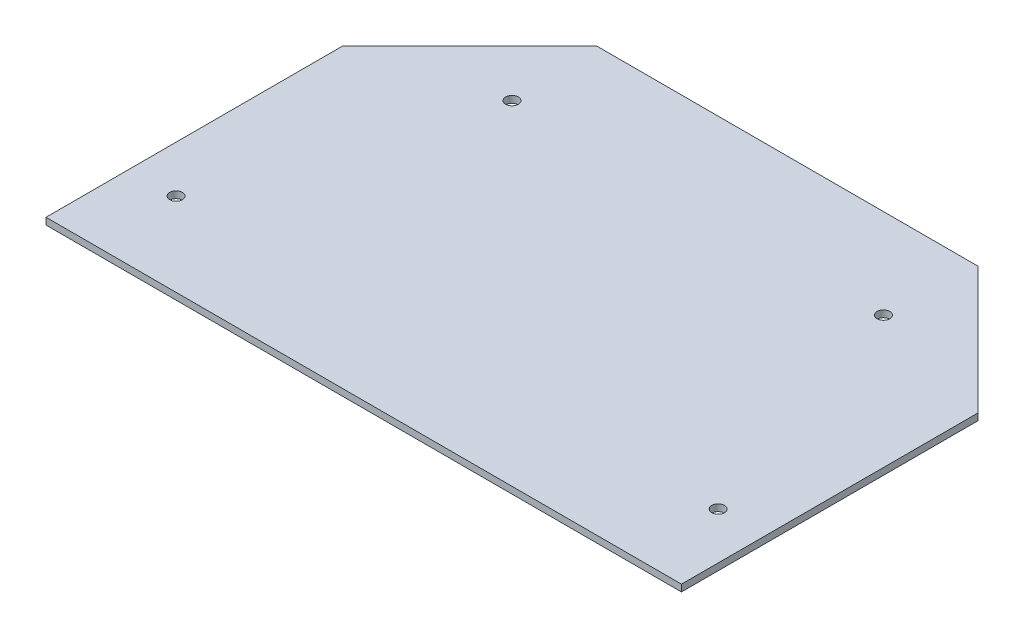
ISO-10303-21;
HEADER;
FILE_DESCRIPTION(('STEP AP214'),'2;1');
FILE_NAME('part.step','',(''),(''),'','','');
FILE_SCHEMA(('AUTOMOTIVE_DESIGN { 1 0 10303 214 1 1 1 1 }'));
ENDSEC;
DATA;
#1=APPLICATION_CONTEXT('core data for automotive mechanical design processes');
#2=APPLICATION_PROTOCOL_DEFINITION('international standard','automotive_design',2000,#1);
#3=PRODUCT_CONTEXT('',#1,'mechanical');
#4=PRODUCT('Part','Part','',(#3));
#5=PRODUCT_RELATED_PRODUCT_CATEGORY('part','',(#4));
#6=PRODUCT_DEFINITION_FORMATION('','',#4);
#7=PRODUCT_DEFINITION_CONTEXT('part definition',#1,'design');
#8=PRODUCT_DEFINITION('design','',#6,#7);
#9=PRODUCT_DEFINITION_SHAPE('','',#8);
#10=(LENGTH_UNIT() NAMED_UNIT(*) SI_UNIT(.MILLI.,.METRE.));
#11=(NAMED_UNIT(*) PLANE_ANGLE_UNIT() SI_UNIT($,.RADIAN.));
#12=(NAMED_UNIT(*) SI_UNIT($,.STERADIAN.) SOLID_ANGLE_UNIT());
#13=UNCERTAINTY_MEASURE_WITH_UNIT(LENGTH_MEASURE(1.E-05),#10,'distance_accuracy_value','');
#14=(GEOMETRIC_REPRESENTATION_CONTEXT(3) GLOBAL_UNCERTAINTY_ASSIGNED_CONTEXT((#13)) GLOBAL_UNIT_ASSIGNED_CONTEXT((#10,
#11,#12)) REPRESENTATION_CONTEXT('',''));
#15=CARTESIAN_POINT('',(0.,0.,0.));
#16=DIRECTION('',(0.,0.,1.));
#17=DIRECTION('',(1.,0.,0.));
#18=AXIS2_PLACEMENT_3D('',#15,#16,#17);
#19=CARTESIAN_POINT('',(0.,1.6,0.));
#20=DIRECTION('',(0.,-1.,0.));
#21=DIRECTION('',(0.,0.,-1.));
#22=AXIS2_PLACEMENT_3D('',#19,#20,#21);
#23=PLANE('',#22);
#24=CARTESIAN_POINT('',(-43.8406204335659,1.6,-43.840620433566));
#25=DIRECTION('',(0.,1.,0.));
#26=DIRECTION('',(0.,0.,1.));
#27=AXIS2_PLACEMENT_3D('',#24,#25,#26);
#28=CIRCLE('',#27,1.49999999999967);
#29=CARTESIAN_POINT('',(-43.8406204335659,1.6,-42.3406204335663));
#30=VERTEX_POINT('',#29);
#31=EDGE_CURVE('E135',#30,#30,#28,.T.);
#32=ORIENTED_EDGE('',*,*,#31,.F.);
#33=EDGE_LOOP('',(#32));
#34=FACE_BOUND('',#33,.T.);
#35=DIRECTION('',(1.,0.,0.));
#36=VECTOR('',#35,1.);
#37=CARTESIAN_POINT('',(0.,1.6,35.));
#38=LINE('',#37,#36);
#39=CARTESIAN_POINT('',(-75.,1.6,35.));
#40=VERTEX_POINT('',#39);
#41=CARTESIAN_POINT('',(75.,1.6,35.));
#42=VERTEX_POINT('',#41);
#43=EDGE_CURVE('E93',#40,#42,#38,.T.);
#44=ORIENTED_EDGE('',*,*,#43,.T.);
#45=DIRECTION('',(0.,0.,1.));
#46=VECTOR('',#45,1.);
#47=CARTESIAN_POINT('',(75.,1.6,35.));
#48=LINE('',#47,#46);
#49=CARTESIAN_POINT('',(75.,1.6,-35.));
#50=VERTEX_POINT('',#49);
#51=EDGE_CURVE('E97',#50,#42,#48,.T.);
#52=ORIENTED_EDGE('',*,*,#51,.F.);
#53=DIRECTION('',(0.707106781186548,0.,0.707106781186547));
#54=VECTOR('',#53,1.);
#55=CARTESIAN_POINT('',(75.,1.6,-35.));
#56=LINE('',#55,#54);
#57=CARTESIAN_POINT('',(45.,1.6,-65.));
#58=VERTEX_POINT('',#57);
#59=EDGE_CURVE('E112',#58,#50,#56,.T.);
#60=ORIENTED_EDGE('',*,*,#59,.F.);
#61=DIRECTION('',(-1.,0.,0.));
#62=VECTOR('',#61,1.);
#63=CARTESIAN_POINT('',(-45.,1.6,-65.));
#64=LINE('',#63,#62);
#65=CARTESIAN_POINT('',(-45.,1.6,-65.));
#66=VERTEX_POINT('',#65);
#67=EDGE_CURVE('E74',#58,#66,#64,.T.);
#68=ORIENTED_EDGE('',*,*,#67,.T.);
#69=DIRECTION('',(-0.707106781186548,0.,0.707106781186547));
#70=VECTOR('',#69,1.);
#71=CARTESIAN_POINT('',(-75.,1.6,-35.));
#72=LINE('',#71,#70);
#73=CARTESIAN_POINT('',(-75.,1.6,-35.));
#74=VERTEX_POINT('',#73);
#75=EDGE_CURVE('E141',#66,#74,#72,.T.);
#76=ORIENTED_EDGE('',*,*,#75,.T.);
#77=DIRECTION('',(0.,0.,1.));
#78=VECTOR('',#77,1.);
#79=CARTESIAN_POINT('',(-75.,1.6,35.));
#80=LINE('',#79,#78);
#81=EDGE_CURVE('E50',#74,#40,#80,.T.);
#82=ORIENTED_EDGE('',*,*,#81,.T.);
#83=EDGE_LOOP('',(#44,#52,#60,#68,#76,#82));
#84=FACE_BOUND('',#83,.T.);
#85=CARTESIAN_POINT('',(-63.979633982947,1.6,15.316867676132));
#86=DIRECTION('',(0.,1.,0.));
#87=DIRECTION('',(0.,0.,1.));
#88=AXIS2_PLACEMENT_3D('',#85,#86,#87);
#89=CIRCLE('',#88,1.5);
#90=CARTESIAN_POINT('',(-63.979633982947,1.6,16.816867676132));
#91=VERTEX_POINT('',#90);
#92=EDGE_CURVE('E129',#91,#91,#89,.T.);
#93=ORIENTED_EDGE('',*,*,#92,.F.);
#94=EDGE_LOOP('',(#93));
#95=FACE_BOUND('',#94,.T.);
#96=CARTESIAN_POINT('',(63.979633982947,1.6,15.316867676132));
#97=DIRECTION('',(0.,-1.,0.));
#98=DIRECTION('',(0.,0.,1.));
#99=AXIS2_PLACEMENT_3D('',#96,#97,#98);
#100=CIRCLE('',#99,1.5);
#101=CARTESIAN_POINT('',(63.979633982947,1.6,16.816867676132));
#102=VERTEX_POINT('',#101);
#103=EDGE_CURVE('E203',#102,#102,#100,.T.);
#104=ORIENTED_EDGE('',*,*,#103,.T.);
#105=EDGE_LOOP('',(#104));
#106=FACE_BOUND('',#105,.T.);
#107=CARTESIAN_POINT('',(43.8406204335659,1.6,-43.840620433566));
#108=DIRECTION('',(0.,-1.,0.));
#109=DIRECTION('',(0.,0.,1.));
#110=AXIS2_PLACEMENT_3D('',#107,#108,#109);
#111=CIRCLE('',#110,1.49999999999967);
#112=CARTESIAN_POINT('',(43.8406204335659,1.6,-42.3406204335663));
#113=VERTEX_POINT('',#112);
#114=EDGE_CURVE('E124',#113,#113,#111,.T.);
#115=ORIENTED_EDGE('',*,*,#114,.T.);
#116=EDGE_LOOP('',(#115));
#117=FACE_BOUND('',#116,.T.);
#118=ADVANCED_FACE('F33',(#34,#84,#95,#106,#117),#23,.F.);
#119=CARTESIAN_POINT('',(0.,0.,0.));
#120=DIRECTION('',(0.,-1.,0.));
#121=DIRECTION('',(0.,0.,-1.));
#122=AXIS2_PLACEMENT_3D('',#119,#120,#121);
#123=PLANE('',#122);
#124=CARTESIAN_POINT('',(-43.8406204335659,0.,-43.840620433566));
#125=DIRECTION('',(0.,1.,0.));
#126=DIRECTION('',(0.,0.,1.));
#127=AXIS2_PLACEMENT_3D('',#124,#125,#126);
#128=CIRCLE('',#127,1.49999999999967);
#129=CARTESIAN_POINT('',(-43.8406204335659,0.,-42.3406204335663));
#130=VERTEX_POINT('',#129);
#131=EDGE_CURVE('E132',#130,#130,#128,.T.);
#132=ORIENTED_EDGE('',*,*,#131,.T.);
#133=EDGE_LOOP('',(#132));
#134=FACE_BOUND('',#133,.T.);
#135=DIRECTION('',(1.,0.,0.));
#136=VECTOR('',#135,1.);
#137=CARTESIAN_POINT('',(0.,0.,35.));
#138=LINE('',#137,#136);
#139=CARTESIAN_POINT('',(-75.,0.,35.));
#140=VERTEX_POINT('',#139);
#141=CARTESIAN_POINT('',(75.,0.,35.));
#142=VERTEX_POINT('',#141);
#143=EDGE_CURVE('E104',#140,#142,#138,.T.);
#144=ORIENTED_EDGE('',*,*,#143,.F.);
#145=DIRECTION('',(0.,0.,1.));
#146=VECTOR('',#145,1.);
#147=CARTESIAN_POINT('',(-75.,0.,35.));
#148=LINE('',#147,#146);
#149=CARTESIAN_POINT('',(-75.,0.,-35.));
#150=VERTEX_POINT('',#149);
#151=EDGE_CURVE('E69',#150,#140,#148,.T.);
#152=ORIENTED_EDGE('',*,*,#151,.F.);
#153=DIRECTION('',(-0.707106781186548,0.,0.707106781186547));
#154=VECTOR('',#153,1.);
#155=CARTESIAN_POINT('',(-75.,0.,-35.));
#156=LINE('',#155,#154);
#157=CARTESIAN_POINT('',(-45.,0.,-65.));
#158=VERTEX_POINT('',#157);
#159=EDGE_CURVE('E64',#158,#150,#156,.T.);
#160=ORIENTED_EDGE('',*,*,#159,.F.);
#161=DIRECTION('',(-1.,0.,0.));
#162=VECTOR('',#161,1.);
#163=CARTESIAN_POINT('',(-45.,0.,-65.));
#164=LINE('',#163,#162);
#165=CARTESIAN_POINT('',(45.,0.,-65.));
#166=VERTEX_POINT('',#165);
#167=EDGE_CURVE('E146',#166,#158,#164,.T.);
#168=ORIENTED_EDGE('',*,*,#167,.F.);
#169=DIRECTION('',(0.707106781186548,0.,0.707106781186547));
#170=VECTOR('',#169,1.);
#171=CARTESIAN_POINT('',(75.,0.,-35.));
#172=LINE('',#171,#170);
#173=CARTESIAN_POINT('',(75.,0.,-35.));
#174=VERTEX_POINT('',#173);
#175=EDGE_CURVE('E113',#166,#174,#172,.T.);
#176=ORIENTED_EDGE('',*,*,#175,.T.);
#177=DIRECTION('',(0.,0.,1.));
#178=VECTOR('',#177,1.);
#179=CARTESIAN_POINT('',(75.,0.,35.));
#180=LINE('',#179,#178);
#181=EDGE_CURVE('E118',#174,#142,#180,.T.);
#182=ORIENTED_EDGE('',*,*,#181,.T.);
#183=EDGE_LOOP('',(#144,#152,#160,#168,#176,#182));
#184=FACE_BOUND('',#183,.T.);
#185=CARTESIAN_POINT('',(-63.979633982947,0.,15.316867676132));
#186=DIRECTION('',(0.,1.,0.));
#187=DIRECTION('',(0.,0.,1.));
#188=AXIS2_PLACEMENT_3D('',#185,#186,#187);
#189=CIRCLE('',#188,1.5);
#190=CARTESIAN_POINT('',(-63.979633982947,0.,16.816867676132));
#191=VERTEX_POINT('',#190);
#192=EDGE_CURVE('E108',#191,#191,#189,.T.);
#193=ORIENTED_EDGE('',*,*,#192,.T.);
#194=EDGE_LOOP('',(#193));
#195=FACE_BOUND('',#194,.T.);
#196=CARTESIAN_POINT('',(63.979633982947,0.,15.316867676132));
#197=DIRECTION('',(0.,-1.,0.));
#198=DIRECTION('',(0.,0.,1.));
#199=AXIS2_PLACEMENT_3D('',#196,#197,#198);
#200=CIRCLE('',#199,1.5);
#201=CARTESIAN_POINT('',(63.979633982947,0.,16.816867676132));
#202=VERTEX_POINT('',#201);
#203=EDGE_CURVE('E206',#202,#202,#200,.T.);
#204=ORIENTED_EDGE('',*,*,#203,.F.);
#205=EDGE_LOOP('',(#204));
#206=FACE_BOUND('',#205,.T.);
#207=CARTESIAN_POINT('',(43.8406204335659,0.,-43.840620433566));
#208=DIRECTION('',(0.,-1.,0.));
#209=DIRECTION('',(0.,0.,1.));
#210=AXIS2_PLACEMENT_3D('',#207,#208,#209);
#211=CIRCLE('',#210,1.49999999999967);
#212=CARTESIAN_POINT('',(43.8406204335659,0.,-42.3406204335663));
#213=VERTEX_POINT('',#212);
#214=EDGE_CURVE('E121',#213,#213,#211,.T.);
#215=ORIENTED_EDGE('',*,*,#214,.F.);
#216=EDGE_LOOP('',(#215));
#217=FACE_BOUND('',#216,.T.);
#218=ADVANCED_FACE('F153',(#134,#184,#195,#206,#217),#123,.T.);
#219=CARTESIAN_POINT('',(0.,1.6,35.));
#220=DIRECTION('',(0.,0.,-1.));
#221=DIRECTION('',(-1.,0.,0.));
#222=AXIS2_PLACEMENT_3D('',#219,#220,#221);
#223=PLANE('',#222);
#224=ORIENTED_EDGE('',*,*,#143,.T.);
#225=DIRECTION('',(0.,-1.,0.));
#226=VECTOR('',#225,1.);
#227=CARTESIAN_POINT('',(75.,1.6,35.));
#228=LINE('',#227,#226);
#229=EDGE_CURVE('E102',#42,#142,#228,.T.);
#230=ORIENTED_EDGE('',*,*,#229,.F.);
#231=ORIENTED_EDGE('',*,*,#43,.F.);
#232=DIRECTION('',(0.,-1.,0.));
#233=VECTOR('',#232,1.);
#234=CARTESIAN_POINT('',(-75.,1.6,35.));
#235=LINE('',#234,#233);
#236=EDGE_CURVE('E144',#40,#140,#235,.T.);
#237=ORIENTED_EDGE('',*,*,#236,.T.);
#238=EDGE_LOOP('',(#224,#230,#231,#237));
#239=FACE_BOUND('',#238,.T.);
#240=ADVANCED_FACE('F35',(#239),#223,.F.);
#241=CARTESIAN_POINT('',(-45.,1.6,-65.));
#242=DIRECTION('',(0.,0.,1.));
#243=DIRECTION('',(1.,0.,0.));
#244=AXIS2_PLACEMENT_3D('',#241,#242,#243);
#245=PLANE('',#244);
#246=ORIENTED_EDGE('',*,*,#167,.T.);
#247=DIRECTION('',(0.,-1.,0.));
#248=VECTOR('',#247,1.);
#249=CARTESIAN_POINT('',(-45.,1.6,-65.));
#250=LINE('',#249,#248);
#251=EDGE_CURVE('E11',#66,#158,#250,.T.);
#252=ORIENTED_EDGE('',*,*,#251,.F.);
#253=ORIENTED_EDGE('',*,*,#67,.F.);
#254=DIRECTION('',(0.,-1.,0.));
#255=VECTOR('',#254,1.);
#256=CARTESIAN_POINT('',(45.,1.6,-65.));
#257=LINE('',#256,#255);
#258=EDGE_CURVE('E115',#58,#166,#257,.T.);
#259=ORIENTED_EDGE('',*,*,#258,.T.);
#260=EDGE_LOOP('',(#246,#252,#253,#259));
#261=FACE_BOUND('',#260,.T.);
#262=ADVANCED_FACE('F160',(#261),#245,.F.);
#263=CARTESIAN_POINT('',(-75.,1.6,-35.));
#264=DIRECTION('',(0.707106781186547,0.,0.707106781186548));
#265=DIRECTION('',(0.707106781186548,0.,-0.707106781186547));
#266=AXIS2_PLACEMENT_3D('',#263,#264,#265);
#267=PLANE('',#266);
#268=ORIENTED_EDGE('',*,*,#159,.T.);
#269=DIRECTION('',(0.,-1.,0.));
#270=VECTOR('',#269,1.);
#271=CARTESIAN_POINT('',(-75.,1.6,-35.));
#272=LINE('',#271,#270);
#273=EDGE_CURVE('E42',#74,#150,#272,.T.);
#274=ORIENTED_EDGE('',*,*,#273,.F.);
#275=ORIENTED_EDGE('',*,*,#75,.F.);
#276=ORIENTED_EDGE('',*,*,#251,.T.);
#277=EDGE_LOOP('',(#268,#274,#275,#276));
#278=FACE_BOUND('',#277,.T.);
#279=ADVANCED_FACE('F161',(#278),#267,.F.);
#280=CARTESIAN_POINT('',(-75.,1.6,35.));
#281=DIRECTION('',(1.,0.,0.));
#282=DIRECTION('',(0.,0.,-1.));
#283=AXIS2_PLACEMENT_3D('',#280,#281,#282);
#284=PLANE('',#283);
#285=ORIENTED_EDGE('',*,*,#151,.T.);
#286=ORIENTED_EDGE('',*,*,#236,.F.);
#287=ORIENTED_EDGE('',*,*,#81,.F.);
#288=ORIENTED_EDGE('',*,*,#273,.T.);
#289=EDGE_LOOP('',(#285,#286,#287,#288));
#290=FACE_BOUND('',#289,.T.);
#291=ADVANCED_FACE('F150',(#290),#284,.F.);
#292=CARTESIAN_POINT('',(-43.8406204335659,1.6,-43.840620433566));
#293=DIRECTION('',(0.,-1.,0.));
#294=DIRECTION('',(0.,0.,-1.));
#295=AXIS2_PLACEMENT_3D('',#292,#293,#294);
#296=CYLINDRICAL_SURFACE('',#295,1.49999999999967);
#297=ORIENTED_EDGE('',*,*,#31,.T.);
#298=EDGE_LOOP('',(#297));
#299=FACE_BOUND('',#298,.T.);
#300=ORIENTED_EDGE('',*,*,#131,.F.);
#301=EDGE_LOOP('',(#300));
#302=FACE_BOUND('',#301,.T.);
#303=ADVANCED_FACE('F168',(#299,#302),#296,.F.);
#304=CARTESIAN_POINT('',(-63.979633982947,1.6,15.316867676132));
#305=DIRECTION('',(0.,-1.,0.));
#306=DIRECTION('',(0.,0.,-1.));
#307=AXIS2_PLACEMENT_3D('',#304,#305,#306);
#308=CYLINDRICAL_SURFACE('',#307,1.5);
#309=ORIENTED_EDGE('',*,*,#92,.T.);
#310=EDGE_LOOP('',(#309));
#311=FACE_BOUND('',#310,.T.);
#312=ORIENTED_EDGE('',*,*,#192,.F.);
#313=EDGE_LOOP('',(#312));
#314=FACE_BOUND('',#313,.T.);
#315=ADVANCED_FACE('F182',(#311,#314),#308,.F.);
#316=CARTESIAN_POINT('',(75.,1.6,35.));
#317=DIRECTION('',(1.,0.,0.));
#318=DIRECTION('',(0.,0.,-1.));
#319=AXIS2_PLACEMENT_3D('',#316,#317,#318);
#320=PLANE('',#319);
#321=ORIENTED_EDGE('',*,*,#181,.F.);
#322=DIRECTION('',(0.,-1.,0.));
#323=VECTOR('',#322,1.);
#324=CARTESIAN_POINT('',(75.,1.6,-35.));
#325=LINE('',#324,#323);
#326=EDGE_CURVE('E109',#50,#174,#325,.T.);
#327=ORIENTED_EDGE('',*,*,#326,.F.);
#328=ORIENTED_EDGE('',*,*,#51,.T.);
#329=ORIENTED_EDGE('',*,*,#229,.T.);
#330=EDGE_LOOP('',(#321,#327,#328,#329));
#331=FACE_BOUND('',#330,.T.);
#332=ADVANCED_FACE('F111',(#331),#320,.T.);
#333=CARTESIAN_POINT('',(75.,1.6,-35.));
#334=DIRECTION('',(0.707106781186547,0.,-0.707106781186548));
#335=DIRECTION('',(-0.707106781186548,0.,-0.707106781186547));
#336=AXIS2_PLACEMENT_3D('',#333,#334,#335);
#337=PLANE('',#336);
#338=ORIENTED_EDGE('',*,*,#175,.F.);
#339=ORIENTED_EDGE('',*,*,#258,.F.);
#340=ORIENTED_EDGE('',*,*,#59,.T.);
#341=ORIENTED_EDGE('',*,*,#326,.T.);
#342=EDGE_LOOP('',(#338,#339,#340,#341));
#343=FACE_BOUND('',#342,.T.);
#344=ADVANCED_FACE('F158',(#343),#337,.T.);
#345=CARTESIAN_POINT('',(43.8406204335659,1.6,-43.840620433566));
#346=DIRECTION('',(0.,-1.,0.));
#347=DIRECTION('',(0.,0.,-1.));
#348=AXIS2_PLACEMENT_3D('',#345,#346,#347);
#349=CYLINDRICAL_SURFACE('',#348,1.49999999999967);
#350=ORIENTED_EDGE('',*,*,#114,.F.);
#351=EDGE_LOOP('',(#350));
#352=FACE_BOUND('',#351,.T.);
#353=ORIENTED_EDGE('',*,*,#214,.T.);
#354=EDGE_LOOP('',(#353));
#355=FACE_BOUND('',#354,.T.);
#356=ADVANCED_FACE('F191',(#352,#355),#349,.F.);
#357=CARTESIAN_POINT('',(63.979633982947,1.6,15.316867676132));
#358=DIRECTION('',(0.,-1.,0.));
#359=DIRECTION('',(0.,0.,-1.));
#360=AXIS2_PLACEMENT_3D('',#357,#358,#359);
#361=CYLINDRICAL_SURFACE('',#360,1.5);
#362=ORIENTED_EDGE('',*,*,#103,.F.);
#363=EDGE_LOOP('',(#362));
#364=FACE_BOUND('',#363,.T.);
#365=ORIENTED_EDGE('',*,*,#203,.T.);
#366=EDGE_LOOP('',(#365));
#367=FACE_BOUND('',#366,.T.);
#368=ADVANCED_FACE('F194',(#364,#367),#361,.F.);
#369=CLOSED_SHELL('',(#118,#218,#240,#262,#279,#291,#303,#315,#332,#344,#356,#368));
#370=MANIFOLD_SOLID_BREP('B2',#369);
#371=ADVANCED_BREP_SHAPE_REPRESENTATION('',(#18,#370),#14);
#372=SHAPE_DEFINITION_REPRESENTATION(#9,#371);
ENDSEC;
END-ISO-10303-21;
